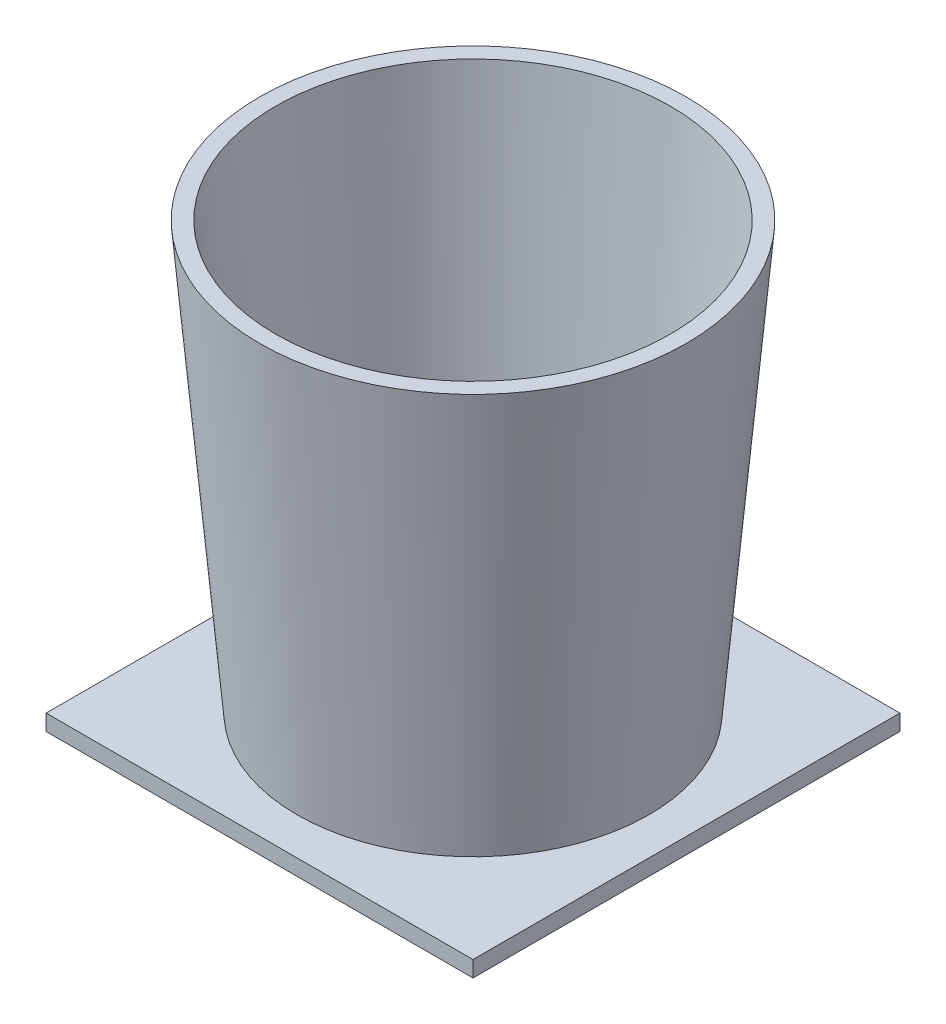
ISO-10303-21;
HEADER;
FILE_DESCRIPTION(('STEP AP214'),'2;1');
FILE_NAME('part.step','',(''),(''),'','','');
FILE_SCHEMA(('AUTOMOTIVE_DESIGN { 1 0 10303 214 1 1 1 1 }'));
ENDSEC;
DATA;
#1=APPLICATION_CONTEXT('core data for automotive mechanical design processes');
#2=APPLICATION_PROTOCOL_DEFINITION('international standard','automotive_design',2000,#1);
#3=PRODUCT_CONTEXT('',#1,'mechanical');
#4=PRODUCT('Part','Part','',(#3));
#5=PRODUCT_RELATED_PRODUCT_CATEGORY('part','',(#4));
#6=PRODUCT_DEFINITION_FORMATION('','',#4);
#7=PRODUCT_DEFINITION_CONTEXT('part definition',#1,'design');
#8=PRODUCT_DEFINITION('design','',#6,#7);
#9=PRODUCT_DEFINITION_SHAPE('','',#8);
#10=(LENGTH_UNIT() NAMED_UNIT(*) SI_UNIT(.MILLI.,.METRE.));
#11=(NAMED_UNIT(*) PLANE_ANGLE_UNIT() SI_UNIT($,.RADIAN.));
#12=(NAMED_UNIT(*) SI_UNIT($,.STERADIAN.) SOLID_ANGLE_UNIT());
#13=UNCERTAINTY_MEASURE_WITH_UNIT(LENGTH_MEASURE(1.E-05),#10,'distance_accuracy_value','');
#14=(GEOMETRIC_REPRESENTATION_CONTEXT(3) GLOBAL_UNCERTAINTY_ASSIGNED_CONTEXT((#13)) GLOBAL_UNIT_ASSIGNED_CONTEXT((#10,
#11,#12)) REPRESENTATION_CONTEXT('',''));
#15=CARTESIAN_POINT('',(0.,0.,0.));
#16=DIRECTION('',(0.,0.,1.));
#17=DIRECTION('',(1.,0.,0.));
#18=AXIS2_PLACEMENT_3D('',#15,#16,#17);
#19=CARTESIAN_POINT('',(0.,3.,0.));
#20=DIRECTION('',(0.,1.,0.));
#21=DIRECTION('',(0.,0.,1.));
#22=AXIS2_PLACEMENT_3D('',#19,#20,#21);
#23=PLANE('',#22);
#24=CARTESIAN_POINT('',(0.,3.,0.));
#25=DIRECTION('',(0.,1.,0.));
#26=DIRECTION('',(0.,0.,1.));
#27=AXIS2_PLACEMENT_3D('',#24,#25,#26);
#28=CIRCLE('',#27,33.0009069179258);
#29=CARTESIAN_POINT('',(0.,3.,33.0009069179258));
#30=VERTEX_POINT('',#29);
#31=EDGE_CURVE('E11',#30,#30,#28,.T.);
#32=ORIENTED_EDGE('',*,*,#31,.F.);
#33=EDGE_LOOP('',(#32));
#34=FACE_BOUND('',#33,.T.);
#35=DIRECTION('',(0.,0.,1.));
#36=VECTOR('',#35,1.);
#37=CARTESIAN_POINT('',(-40.,3.,-40.));
#38=LINE('',#37,#36);
#39=CARTESIAN_POINT('',(-40.,3.,-40.));
#40=VERTEX_POINT('',#39);
#41=CARTESIAN_POINT('',(-40.,3.,40.));
#42=VERTEX_POINT('',#41);
#43=EDGE_CURVE('E84',#40,#42,#38,.T.);
#44=ORIENTED_EDGE('',*,*,#43,.T.);
#45=DIRECTION('',(1.,0.,0.));
#46=VECTOR('',#45,1.);
#47=CARTESIAN_POINT('',(-40.,3.,40.));
#48=LINE('',#47,#46);
#49=CARTESIAN_POINT('',(40.,3.,40.));
#50=VERTEX_POINT('',#49);
#51=EDGE_CURVE('E80',#42,#50,#48,.T.);
#52=ORIENTED_EDGE('',*,*,#51,.T.);
#53=DIRECTION('',(0.,0.,-1.));
#54=VECTOR('',#53,1.);
#55=CARTESIAN_POINT('',(40.,3.,-40.));
#56=LINE('',#55,#54);
#57=CARTESIAN_POINT('',(40.,3.,-40.));
#58=VERTEX_POINT('',#57);
#59=EDGE_CURVE('E82',#50,#58,#56,.T.);
#60=ORIENTED_EDGE('',*,*,#59,.T.);
#61=DIRECTION('',(-1.,0.,0.));
#62=VECTOR('',#61,1.);
#63=CARTESIAN_POINT('',(-40.,3.,-40.));
#64=LINE('',#63,#62);
#65=EDGE_CURVE('E49',#58,#40,#64,.T.);
#66=ORIENTED_EDGE('',*,*,#65,.T.);
#67=EDGE_LOOP('',(#44,#52,#60,#66));
#68=FACE_BOUND('',#67,.T.);
#69=ADVANCED_FACE('F32',(#34,#68),#23,.T.);
#70=CARTESIAN_POINT('',(-40.,3.,-40.));
#71=DIRECTION('',(1.,0.,0.));
#72=DIRECTION('',(0.,0.,-1.));
#73=AXIS2_PLACEMENT_3D('',#70,#71,#72);
#74=PLANE('',#73);
#75=DIRECTION('',(0.,0.,1.));
#76=VECTOR('',#75,1.);
#77=CARTESIAN_POINT('',(-40.,0.,-40.));
#78=LINE('',#77,#76);
#79=CARTESIAN_POINT('',(-40.,0.,-40.));
#80=VERTEX_POINT('',#79);
#81=CARTESIAN_POINT('',(-40.,0.,40.));
#82=VERTEX_POINT('',#81);
#83=EDGE_CURVE('E99',#80,#82,#78,.T.);
#84=ORIENTED_EDGE('',*,*,#83,.T.);
#85=DIRECTION('',(0.,-1.,0.));
#86=VECTOR('',#85,1.);
#87=CARTESIAN_POINT('',(-40.,3.,40.));
#88=LINE('',#87,#86);
#89=EDGE_CURVE('E90',#42,#82,#88,.T.);
#90=ORIENTED_EDGE('',*,*,#89,.F.);
#91=ORIENTED_EDGE('',*,*,#43,.F.);
#92=DIRECTION('',(0.,-1.,0.));
#93=VECTOR('',#92,1.);
#94=CARTESIAN_POINT('',(-40.,3.,-40.));
#95=LINE('',#94,#93);
#96=EDGE_CURVE('E95',#40,#80,#95,.T.);
#97=ORIENTED_EDGE('',*,*,#96,.T.);
#98=EDGE_LOOP('',(#84,#90,#91,#97));
#99=FACE_BOUND('',#98,.T.);
#100=ADVANCED_FACE('F34',(#99),#74,.F.);
#101=CARTESIAN_POINT('',(-40.,3.,40.));
#102=DIRECTION('',(0.,0.,-1.));
#103=DIRECTION('',(-1.,0.,0.));
#104=AXIS2_PLACEMENT_3D('',#101,#102,#103);
#105=PLANE('',#104);
#106=DIRECTION('',(1.,0.,0.));
#107=VECTOR('',#106,1.);
#108=CARTESIAN_POINT('',(-40.,0.,40.));
#109=LINE('',#108,#107);
#110=CARTESIAN_POINT('',(40.,0.,40.));
#111=VERTEX_POINT('',#110);
#112=EDGE_CURVE('E89',#82,#111,#109,.T.);
#113=ORIENTED_EDGE('',*,*,#112,.T.);
#114=DIRECTION('',(0.,-1.,0.));
#115=VECTOR('',#114,1.);
#116=CARTESIAN_POINT('',(40.,3.,40.));
#117=LINE('',#116,#115);
#118=EDGE_CURVE('E87',#50,#111,#117,.T.);
#119=ORIENTED_EDGE('',*,*,#118,.F.);
#120=ORIENTED_EDGE('',*,*,#51,.F.);
#121=ORIENTED_EDGE('',*,*,#89,.T.);
#122=EDGE_LOOP('',(#113,#119,#120,#121));
#123=FACE_BOUND('',#122,.T.);
#124=ADVANCED_FACE('F88',(#123),#105,.F.);
#125=CARTESIAN_POINT('',(40.,3.,-40.));
#126=DIRECTION('',(-1.,0.,0.));
#127=DIRECTION('',(0.,0.,1.));
#128=AXIS2_PLACEMENT_3D('',#125,#126,#127);
#129=PLANE('',#128);
#130=DIRECTION('',(0.,0.,-1.));
#131=VECTOR('',#130,1.);
#132=CARTESIAN_POINT('',(40.,0.,-40.));
#133=LINE('',#132,#131);
#134=CARTESIAN_POINT('',(40.,0.,-40.));
#135=VERTEX_POINT('',#134);
#136=EDGE_CURVE('E66',#111,#135,#133,.T.);
#137=ORIENTED_EDGE('',*,*,#136,.T.);
#138=DIRECTION('',(0.,-1.,0.));
#139=VECTOR('',#138,1.);
#140=CARTESIAN_POINT('',(40.,3.,-40.));
#141=LINE('',#140,#139);
#142=EDGE_CURVE('E91',#58,#135,#141,.T.);
#143=ORIENTED_EDGE('',*,*,#142,.F.);
#144=ORIENTED_EDGE('',*,*,#59,.F.);
#145=ORIENTED_EDGE('',*,*,#118,.T.);
#146=EDGE_LOOP('',(#137,#143,#144,#145));
#147=FACE_BOUND('',#146,.T.);
#148=ADVANCED_FACE('F93',(#147),#129,.F.);
#149=CARTESIAN_POINT('',(-40.,3.,-40.));
#150=DIRECTION('',(0.,0.,1.));
#151=DIRECTION('',(1.,0.,0.));
#152=AXIS2_PLACEMENT_3D('',#149,#150,#151);
#153=PLANE('',#152);
#154=DIRECTION('',(-1.,0.,0.));
#155=VECTOR('',#154,1.);
#156=CARTESIAN_POINT('',(-40.,0.,-40.));
#157=LINE('',#156,#155);
#158=EDGE_CURVE('E72',#135,#80,#157,.T.);
#159=ORIENTED_EDGE('',*,*,#158,.T.);
#160=ORIENTED_EDGE('',*,*,#96,.F.);
#161=ORIENTED_EDGE('',*,*,#65,.F.);
#162=ORIENTED_EDGE('',*,*,#142,.T.);
#163=EDGE_LOOP('',(#159,#160,#161,#162));
#164=FACE_BOUND('',#163,.T.);
#165=ADVANCED_FACE('F142',(#164),#153,.F.);
#166=CARTESIAN_POINT('',(0.,0.,0.));
#167=DIRECTION('',(0.,1.,0.));
#168=DIRECTION('',(0.,0.,1.));
#169=AXIS2_PLACEMENT_3D('',#166,#167,#168);
#170=PLANE('',#169);
#171=ORIENTED_EDGE('',*,*,#83,.F.);
#172=ORIENTED_EDGE('',*,*,#158,.F.);
#173=ORIENTED_EDGE('',*,*,#136,.F.);
#174=ORIENTED_EDGE('',*,*,#112,.F.);
#175=EDGE_LOOP('',(#171,#172,#173,#174));
#176=FACE_BOUND('',#175,.T.);
#177=ADVANCED_FACE('F134',(#176),#170,.F.);
#178=CARTESIAN_POINT('',(0.,3.,0.));
#179=DIRECTION('',(0.,1.,0.));
#180=DIRECTION('',(0.,0.,1.));
#181=AXIS2_PLACEMENT_3D('',#178,#179,#180);
#182=CONICAL_SURFACE('',#181,33.0009069179258,0.0872664625997203);
#183=CARTESIAN_POINT('',(0.,83.,0.));
#184=DIRECTION('',(0.,-1.,0.));
#185=DIRECTION('',(0.,0.,-1.));
#186=AXIS2_PLACEMENT_3D('',#183,#184,#185);
#187=CIRCLE('',#186,40.);
#188=CARTESIAN_POINT('',(0.,83.,-40.));
#189=VERTEX_POINT('',#188);
#190=EDGE_CURVE('E102',#189,#189,#187,.T.);
#191=ORIENTED_EDGE('',*,*,#190,.T.);
#192=EDGE_LOOP('',(#191));
#193=FACE_BOUND('',#192,.T.);
#194=ORIENTED_EDGE('',*,*,#31,.T.);
#195=EDGE_LOOP('',(#194));
#196=FACE_BOUND('',#195,.T.);
#197=ADVANCED_FACE('F132',(#193,#196),#182,.T.);
#198=CARTESIAN_POINT('',(40.,83.,0.));
#199=DIRECTION('',(0.,1.,0.));
#200=DIRECTION('',(0.,0.,1.));
#201=AXIS2_PLACEMENT_3D('',#198,#199,#200);
#202=PLANE('',#201);
#203=CARTESIAN_POINT('',(0.,83.,0.));
#204=DIRECTION('',(0.,-1.,0.));
#205=DIRECTION('',(0.,0.,-1.));
#206=AXIS2_PLACEMENT_3D('',#203,#204,#205);
#207=CIRCLE('',#206,37.);
#208=CARTESIAN_POINT('',(0.,83.,-37.));
#209=VERTEX_POINT('',#208);
#210=EDGE_CURVE('E147',#209,#209,#207,.T.);
#211=ORIENTED_EDGE('',*,*,#210,.T.);
#212=EDGE_LOOP('',(#211));
#213=FACE_BOUND('',#212,.T.);
#214=ORIENTED_EDGE('',*,*,#190,.F.);
#215=EDGE_LOOP('',(#214));
#216=FACE_BOUND('',#215,.T.);
#217=ADVANCED_FACE('F120',(#213,#216),#202,.T.);
#218=CARTESIAN_POINT('',(0.,83.,0.));
#219=DIRECTION('',(0.,1.,0.));
#220=DIRECTION('',(0.,0.,1.));
#221=AXIS2_PLACEMENT_3D('',#218,#219,#220);
#222=CONICAL_SURFACE('',#221,37.,0.0872664625997201);
#223=CARTESIAN_POINT('',(0.,3.,0.));
#224=DIRECTION('',(0.,1.,0.));
#225=DIRECTION('',(0.,0.,1.));
#226=AXIS2_PLACEMENT_3D('',#223,#224,#225);
#227=CIRCLE('',#226,30.0009069179258);
#228=CARTESIAN_POINT('',(0.,3.,30.0009069179258));
#229=VERTEX_POINT('',#228);
#230=EDGE_CURVE('E41',#229,#229,#227,.F.);
#231=ORIENTED_EDGE('',*,*,#230,.T.);
#232=EDGE_LOOP('',(#231));
#233=FACE_BOUND('',#232,.T.);
#234=ORIENTED_EDGE('',*,*,#210,.F.);
#235=EDGE_LOOP('',(#234));
#236=FACE_BOUND('',#235,.T.);
#237=ADVANCED_FACE('F111',(#233,#236),#222,.F.);
#238=ORIENTED_EDGE('',*,*,#230,.F.);
#239=EDGE_LOOP('',(#238));
#240=FACE_BOUND('',#239,.T.);
#241=ADVANCED_FACE('F114',(#240),#23,.T.);
#242=CLOSED_SHELL('',(#69,#100,#124,#148,#165,#177,#197,#217,#237,#241));
#243=MANIFOLD_SOLID_BREP('B2',#242);
#244=ADVANCED_BREP_SHAPE_REPRESENTATION('',(#18,#243),#14);
#245=SHAPE_DEFINITION_REPRESENTATION(#9,#244);
ENDSEC;
END-ISO-10303-21;
